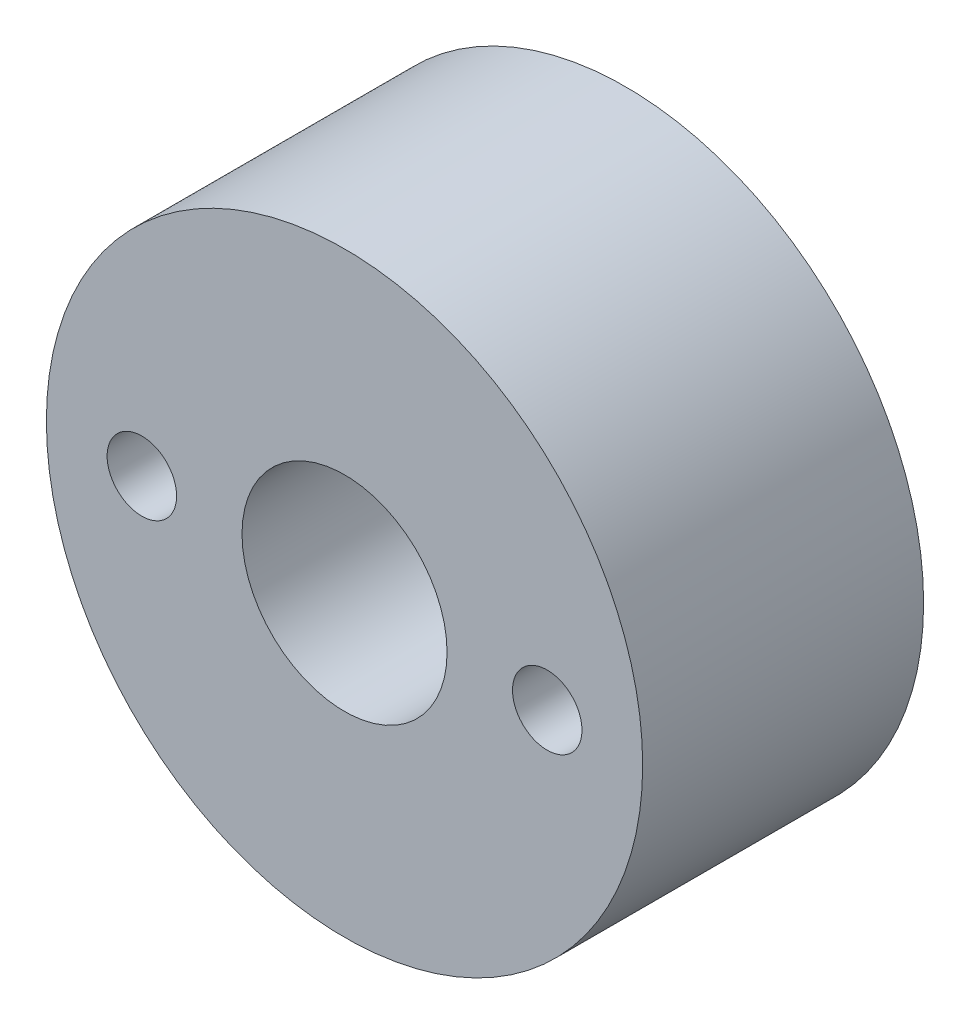
ISO-10303-21;
HEADER;
FILE_DESCRIPTION(('STEP AP214'),'2;1');
FILE_NAME('part.step','',(''),(''),'','','');
FILE_SCHEMA(('AUTOMOTIVE_DESIGN { 1 0 10303 214 1 1 1 1 }'));
ENDSEC;
DATA;
#1=APPLICATION_CONTEXT('core data for automotive mechanical design processes');
#2=APPLICATION_PROTOCOL_DEFINITION('international standard','automotive_design',2000,#1);
#3=PRODUCT_CONTEXT('',#1,'mechanical');
#4=PRODUCT('Part','Part','',(#3));
#5=PRODUCT_RELATED_PRODUCT_CATEGORY('part','',(#4));
#6=PRODUCT_DEFINITION_FORMATION('','',#4);
#7=PRODUCT_DEFINITION_CONTEXT('part definition',#1,'design');
#8=PRODUCT_DEFINITION('design','',#6,#7);
#9=PRODUCT_DEFINITION_SHAPE('','',#8);
#10=(LENGTH_UNIT() NAMED_UNIT(*) SI_UNIT(.MILLI.,.METRE.));
#11=(NAMED_UNIT(*) PLANE_ANGLE_UNIT() SI_UNIT($,.RADIAN.));
#12=(NAMED_UNIT(*) SI_UNIT($,.STERADIAN.) SOLID_ANGLE_UNIT());
#13=UNCERTAINTY_MEASURE_WITH_UNIT(LENGTH_MEASURE(1.E-05),#10,'distance_accuracy_value','');
#14=(GEOMETRIC_REPRESENTATION_CONTEXT(3) GLOBAL_UNCERTAINTY_ASSIGNED_CONTEXT((#13)) GLOBAL_UNIT_ASSIGNED_CONTEXT((#10,
#11,#12)) REPRESENTATION_CONTEXT('',''));
#15=CARTESIAN_POINT('',(0.,0.,0.));
#16=DIRECTION('',(0.,0.,1.));
#17=DIRECTION('',(1.,0.,0.));
#18=AXIS2_PLACEMENT_3D('',#15,#16,#17);
#19=CARTESIAN_POINT('',(18.9434723123043,23.6735889318227,0.));
#20=DIRECTION('',(0.,0.,-1.));
#21=DIRECTION('',(-1.,0.,0.));
#22=AXIS2_PLACEMENT_3D('',#19,#20,#21);
#23=PLANE('',#22);
#24=CARTESIAN_POINT('',(0.,0.,0.));
#25=DIRECTION('',(0.,0.,-1.));
#26=DIRECTION('',(-1.,0.,0.));
#27=AXIS2_PLACEMENT_3D('',#24,#25,#26);
#28=CIRCLE('',#27,14.5880115884789);
#29=CARTESIAN_POINT('',(-14.5880115884789,0.,0.));
#30=VERTEX_POINT('',#29);
#31=EDGE_CURVE('E40',#30,#30,#28,.T.);
#32=ORIENTED_EDGE('',*,*,#31,.F.);
#33=EDGE_LOOP('',(#32));
#34=FACE_BOUND('',#33,.T.);
#35=CARTESIAN_POINT('',(9.91665428511723,0.,0.));
#36=DIRECTION('',(0.,0.,-1.));
#37=DIRECTION('',(-1.,0.,0.));
#38=AXIS2_PLACEMENT_3D('',#35,#36,#37);
#39=CIRCLE('',#38,1.7);
#40=CARTESIAN_POINT('',(11.6166542851172,0.,0.));
#41=VERTEX_POINT('',#40);
#42=EDGE_CURVE('E55',#41,#41,#39,.T.);
#43=ORIENTED_EDGE('',*,*,#42,.T.);
#44=EDGE_LOOP('',(#43));
#45=FACE_BOUND('',#44,.T.);
#46=CARTESIAN_POINT('',(-9.91665428511723,0.,0.));
#47=DIRECTION('',(0.,0.,-1.));
#48=DIRECTION('',(-1.,0.,0.));
#49=AXIS2_PLACEMENT_3D('',#46,#47,#48);
#50=CIRCLE('',#49,1.7);
#51=CARTESIAN_POINT('',(-8.21665428511723,0.,0.));
#52=VERTEX_POINT('',#51);
#53=EDGE_CURVE('E58',#52,#52,#50,.T.);
#54=ORIENTED_EDGE('',*,*,#53,.T.);
#55=EDGE_LOOP('',(#54));
#56=FACE_BOUND('',#55,.T.);
#57=CARTESIAN_POINT('',(0.,0.,0.));
#58=DIRECTION('',(0.,0.,-1.));
#59=DIRECTION('',(-1.,0.,0.));
#60=AXIS2_PLACEMENT_3D('',#57,#58,#59);
#61=CIRCLE('',#60,5.0165);
#62=CARTESIAN_POINT('',(-5.0165,0.,0.));
#63=VERTEX_POINT('',#62);
#64=EDGE_CURVE('E60',#63,#63,#61,.F.);
#65=ORIENTED_EDGE('',*,*,#64,.F.);
#66=EDGE_LOOP('',(#65));
#67=FACE_BOUND('',#66,.T.);
#68=ADVANCED_FACE('F36',(#34,#45,#56,#67),#23,.F.);
#69=CARTESIAN_POINT('',(-8.32907412950175,5.3820587469665,-11.745));
#70=DIRECTION('',(0.,0.,1.));
#71=DIRECTION('',(1.,0.,0.));
#72=AXIS2_PLACEMENT_3D('',#69,#70,#71);
#73=PLANE('',#72);
#74=CARTESIAN_POINT('',(-8.32907412950175,5.3820587469665,-11.745));
#75=DIRECTION('',(0.,0.,-1.));
#76=DIRECTION('',(1.,0.,0.));
#77=AXIS2_PLACEMENT_3D('',#74,#75,#76);
#78=CIRCLE('',#77,1.2);
#79=CARTESIAN_POINT('',(-7.12907412950175,5.3820587469665,-11.745));
#80=VERTEX_POINT('',#79);
#81=EDGE_CURVE('E90',#80,#80,#78,.T.);
#82=ORIENTED_EDGE('',*,*,#81,.T.);
#83=EDGE_LOOP('',(#82));
#84=FACE_BOUND('',#83,.T.);
#85=ADVANCED_FACE('F100',(#84),#73,.F.);
#86=CARTESIAN_POINT('',(-8.32907412950175,-5.3820587469665,-11.745));
#87=DIRECTION('',(0.,0.,-1.));
#88=DIRECTION('',(-1.,0.,0.));
#89=AXIS2_PLACEMENT_3D('',#86,#87,#88);
#90=PLANE('',#89);
#91=CARTESIAN_POINT('',(-8.32907412950175,-5.3820587469665,-11.745));
#92=DIRECTION('',(0.,0.,-1.));
#93=DIRECTION('',(-1.,0.,0.));
#94=AXIS2_PLACEMENT_3D('',#91,#92,#93);
#95=CIRCLE('',#94,1.2);
#96=CARTESIAN_POINT('',(-9.52907412950175,-5.3820587469665,-11.745));
#97=VERTEX_POINT('',#96);
#98=EDGE_CURVE('E85',#97,#97,#95,.T.);
#99=ORIENTED_EDGE('',*,*,#98,.T.);
#100=EDGE_LOOP('',(#99));
#101=FACE_BOUND('',#100,.T.);
#102=ADVANCED_FACE('F133',(#101),#90,.T.);
#103=CARTESIAN_POINT('',(-9.91665428511723,0.,-16.745));
#104=DIRECTION('',(0.,0.,1.));
#105=DIRECTION('',(1.,0.,0.));
#106=AXIS2_PLACEMENT_3D('',#103,#104,#105);
#107=CYLINDRICAL_SURFACE('',#106,2.8);
#108=CARTESIAN_POINT('',(-9.91665428511723,0.,-16.745));
#109=DIRECTION('',(0.,0.,-1.));
#110=DIRECTION('',(-1.,0.,0.));
#111=AXIS2_PLACEMENT_3D('',#108,#109,#110);
#112=CIRCLE('',#111,2.8);
#113=CARTESIAN_POINT('',(-12.7166542851172,0.,-16.745));
#114=VERTEX_POINT('',#113);
#115=EDGE_CURVE('E45',#114,#114,#112,.T.);
#116=ORIENTED_EDGE('',*,*,#115,.F.);
#117=EDGE_LOOP('',(#116));
#118=FACE_BOUND('',#117,.T.);
#119=CARTESIAN_POINT('',(-9.91665428511723,0.,-13.745));
#120=DIRECTION('',(0.,0.,1.));
#121=DIRECTION('',(1.,0.,0.));
#122=AXIS2_PLACEMENT_3D('',#119,#120,#121);
#123=CIRCLE('',#122,2.8);
#124=CARTESIAN_POINT('',(-7.11665428511723,0.,-13.745));
#125=VERTEX_POINT('',#124);
#126=EDGE_CURVE('E62',#125,#125,#123,.F.);
#127=ORIENTED_EDGE('',*,*,#126,.T.);
#128=EDGE_LOOP('',(#127));
#129=FACE_BOUND('',#128,.T.);
#130=ADVANCED_FACE('F141',(#118,#129),#107,.T.);
#131=CARTESIAN_POINT('',(-9.91665428511723,0.,-16.745));
#132=DIRECTION('',(0.,0.,-1.));
#133=DIRECTION('',(-1.,0.,0.));
#134=AXIS2_PLACEMENT_3D('',#131,#132,#133);
#135=PLANE('',#134);
#136=ORIENTED_EDGE('',*,*,#115,.T.);
#137=EDGE_LOOP('',(#136));
#138=FACE_BOUND('',#137,.T.);
#139=CARTESIAN_POINT('',(-9.91665428511723,0.,-16.745));
#140=DIRECTION('',(0.,0.,-1.));
#141=DIRECTION('',(-1.,0.,0.));
#142=AXIS2_PLACEMENT_3D('',#139,#140,#141);
#143=CIRCLE('',#142,1.7);
#144=CARTESIAN_POINT('',(-8.21665428511723,0.,-16.745));
#145=VERTEX_POINT('',#144);
#146=EDGE_CURVE('E10',#145,#145,#143,.T.);
#147=ORIENTED_EDGE('',*,*,#146,.F.);
#148=EDGE_LOOP('',(#147));
#149=FACE_BOUND('',#148,.T.);
#150=ADVANCED_FACE('F138',(#138,#149),#135,.T.);
#151=CARTESIAN_POINT('',(-9.91665428511723,0.,-21.2539484015982));
#152=DIRECTION('',(0.,0.,1.));
#153=DIRECTION('',(1.,0.,0.));
#154=AXIS2_PLACEMENT_3D('',#151,#152,#153);
#155=CYLINDRICAL_SURFACE('',#154,1.7);
#156=CARTESIAN_POINT('',(-8.21665428511723,0.,0.));
#157=CARTESIAN_POINT('',(-8.21665428511723,0.,-0.17442708333333));
#158=CARTESIAN_POINT('',(-8.21665428511723,0.,-0.348854166666663));
#159=CARTESIAN_POINT('',(-8.21665428511723,0.,-0.69770833333333));
#160=CARTESIAN_POINT('',(-8.21665428511723,0.,-0.872135416666664));
#161=CARTESIAN_POINT('',(-8.21665428511723,0.,-1.22098958333333));
#162=CARTESIAN_POINT('',(-8.21665428511723,0.,-1.39541666666666));
#163=CARTESIAN_POINT('',(-8.21665428511723,0.,-1.74427083333333));
#164=CARTESIAN_POINT('',(-8.21665428511723,0.,-1.91869791666666));
#165=CARTESIAN_POINT('',(-8.21665428511723,0.,-2.26755208333333));
#166=CARTESIAN_POINT('',(-8.21665428511723,0.,-2.44197916666666));
#167=CARTESIAN_POINT('',(-8.21665428511723,0.,-2.79083333333333));
#168=CARTESIAN_POINT('',(-8.21665428511723,0.,-2.96526041666666));
#169=CARTESIAN_POINT('',(-8.21665428511723,0.,-3.31411458333333));
#170=CARTESIAN_POINT('',(-8.21665428511723,0.,-3.48854166666667));
#171=CARTESIAN_POINT('',(-8.21665428511723,0.,-3.83739583333333));
#172=CARTESIAN_POINT('',(-8.21665428511723,0.,-4.01182291666667));
#173=CARTESIAN_POINT('',(-8.21665428511723,0.,-4.36067708333333));
#174=CARTESIAN_POINT('',(-8.21665428511723,0.,-4.53510416666667));
#175=CARTESIAN_POINT('',(-8.21665428511723,0.,-4.88395833333333));
#176=CARTESIAN_POINT('',(-8.21665428511723,0.,-5.05838541666667));
#177=CARTESIAN_POINT('',(-8.21665428511723,0.,-5.40723958333333));
#178=CARTESIAN_POINT('',(-8.21665428511723,0.,-5.58166666666667));
#179=CARTESIAN_POINT('',(-8.21665428511723,0.,-5.93052083333333));
#180=CARTESIAN_POINT('',(-8.21665428511723,0.,-6.10494791666666));
#181=CARTESIAN_POINT('',(-8.21665428511723,0.,-6.45380208333333));
#182=CARTESIAN_POINT('',(-8.21665428511723,0.,-6.62822916666666));
#183=CARTESIAN_POINT('',(-8.21665428511723,0.,-6.97708333333333));
#184=CARTESIAN_POINT('',(-8.21665428511723,0.,-7.15151041666666));
#185=CARTESIAN_POINT('',(-8.21665428511723,0.,-7.50036458333333));
#186=CARTESIAN_POINT('',(-8.21665428511723,0.,-7.67479166666666));
#187=CARTESIAN_POINT('',(-8.21665428511723,0.,-8.02364583333333));
#188=CARTESIAN_POINT('',(-8.21665428511723,0.,-8.19807291666667));
#189=CARTESIAN_POINT('',(-8.21665428511723,0.,-8.54692708333333));
#190=CARTESIAN_POINT('',(-8.21665428511723,0.,-8.72135416666667));
#191=CARTESIAN_POINT('',(-8.21665428511723,0.,-9.07020833333333));
#192=CARTESIAN_POINT('',(-8.21665428511723,0.,-9.24463541666667));
#193=CARTESIAN_POINT('',(-8.21665428511723,0.,-9.59348958333333));
#194=CARTESIAN_POINT('',(-8.21665428511723,0.,-9.76791666666667));
#195=CARTESIAN_POINT('',(-8.21665428511723,0.,-10.1167708333333));
#196=CARTESIAN_POINT('',(-8.21665428511723,0.,-10.2911979166667));
#197=CARTESIAN_POINT('',(-8.21665428511723,0.,-10.6400520833333));
#198=CARTESIAN_POINT('',(-8.21665428511723,0.,-10.8144791666667));
#199=CARTESIAN_POINT('',(-8.21665428511723,0.,-11.1633333333333));
#200=CARTESIAN_POINT('',(-8.21665428511723,0.,-11.3377604166667));
#201=CARTESIAN_POINT('',(-8.21665428511723,0.,-11.6866145833333));
#202=CARTESIAN_POINT('',(-8.21665428511723,0.,-11.8610416666667));
#203=CARTESIAN_POINT('',(-8.21665428511723,0.,-12.2098958333333));
#204=CARTESIAN_POINT('',(-8.21665428511723,0.,-12.3843229166667));
#205=CARTESIAN_POINT('',(-8.21665428511723,0.,-12.7331770833333));
#206=CARTESIAN_POINT('',(-8.21665428511723,0.,-12.9076041666667));
#207=CARTESIAN_POINT('',(-8.21665428511723,0.,-13.2564583333333));
#208=CARTESIAN_POINT('',(-8.21665428511723,0.,-13.4308854166667));
#209=CARTESIAN_POINT('',(-8.21665428511723,0.,-13.7797395833333));
#210=CARTESIAN_POINT('',(-8.21665428511723,0.,-13.9541666666667));
#211=CARTESIAN_POINT('',(-8.21665428511723,0.,-14.3030208333333));
#212=CARTESIAN_POINT('',(-8.21665428511723,0.,-14.4774479166667));
#213=CARTESIAN_POINT('',(-8.21665428511723,0.,-14.8263020833333));
#214=CARTESIAN_POINT('',(-8.21665428511723,0.,-15.0007291666667));
#215=CARTESIAN_POINT('',(-8.21665428511723,0.,-15.3495833333333));
#216=CARTESIAN_POINT('',(-8.21665428511723,0.,-15.5240104166667));
#217=CARTESIAN_POINT('',(-8.21665428511723,0.,-15.8728645833333));
#218=CARTESIAN_POINT('',(-8.21665428511723,0.,-16.0472916666667));
#219=CARTESIAN_POINT('',(-8.21665428511723,0.,-16.3961458333333));
#220=CARTESIAN_POINT('',(-8.21665428511723,0.,-16.5705729166667));
#221=CARTESIAN_POINT('',(-8.21665428511723,0.,-16.745));
#222=B_SPLINE_CURVE_WITH_KNOTS('',3,(#156,#157,#158,#159,#160,#161,#162,#163,#164,#165,#166,
#167,#168,#169,#170,#171,#172,#173,#174,#175,#176,#177,#178,#179,#180,#181,#182,#183,#184,#185,
#186,#187,#188,#189,#190,#191,#192,#193,#194,#195,#196,#197,#198,#199,#200,#201,#202,#203,#204,
#205,#206,#207,#208,#209,#210,#211,#212,#213,#214,#215,#216,#217,#218,#219,#220,#221),
.UNSPECIFIED.,.F.,.F.,(4,2,2,2,2,2,2,2,2,2,2,2,2,2,2,2,2,2,2,2,2,2,2,2,2,2,2,2,2,2,2,2,4),(0.,
0.52328125,1.0465625,1.56984375,2.093125,2.61640625,3.1396875,3.66296875,4.18625,4.70953125,
5.2328125,5.75609375,6.279375,6.80265625,7.3259375,7.84921875,8.3725,8.89578125,9.4190625,
9.94234375,10.465625,10.98890625,11.5121875,12.03546875,12.55875,13.08203125,13.6053125,
14.12859375,14.651875,15.17515625,15.6984375,16.22171875,16.745),.UNSPECIFIED.);
#223=EDGE_CURVE('BSEAM106',#52,#145,#222,.T.);
#224=ORIENTED_EDGE('',*,*,#53,.F.);
#225=ORIENTED_EDGE('',*,*,#146,.T.);
#226=ORIENTED_EDGE('',*,*,#223,.T.);
#227=ORIENTED_EDGE('',*,*,#223,.F.);
#228=EDGE_LOOP('',(#224,#226,#225,#227));
#229=FACE_BOUND('',#228,.T.);
#230=ADVANCED_FACE('F106',(#229),#155,.F.);
#231=CARTESIAN_POINT('',(-8.32907412950175,5.3820587469665,-11.745));
#232=DIRECTION('',(0.,0.,-1.));
#233=DIRECTION('',(-1.,0.,0.));
#234=AXIS2_PLACEMENT_3D('',#231,#232,#233);
#235=CYLINDRICAL_SURFACE('',#234,1.2);
#236=ORIENTED_EDGE('',*,*,#81,.F.);
#237=EDGE_LOOP('',(#236));
#238=FACE_BOUND('',#237,.T.);
#239=CARTESIAN_POINT('',(-8.32907412950175,5.3820587469665,-13.745));
#240=DIRECTION('',(0.,0.,-1.));
#241=DIRECTION('',(1.,0.,0.));
#242=AXIS2_PLACEMENT_3D('',#239,#240,#241);
#243=CIRCLE('',#242,1.2);
#244=CARTESIAN_POINT('',(-7.12907412950175,5.3820587469665,-13.745));
#245=VERTEX_POINT('',#244);
#246=EDGE_CURVE('E51',#245,#245,#243,.T.);
#247=ORIENTED_EDGE('',*,*,#246,.T.);
#248=EDGE_LOOP('',(#247));
#249=FACE_BOUND('',#248,.T.);
#250=ADVANCED_FACE('F102',(#238,#249),#235,.F.);
#251=CARTESIAN_POINT('',(-8.32907412950175,-5.3820587469665,-11.745));
#252=DIRECTION('',(0.,0.,-1.));
#253=DIRECTION('',(-1.,0.,0.));
#254=AXIS2_PLACEMENT_3D('',#251,#252,#253);
#255=CYLINDRICAL_SURFACE('',#254,1.2);
#256=ORIENTED_EDGE('',*,*,#98,.F.);
#257=EDGE_LOOP('',(#256));
#258=FACE_BOUND('',#257,.T.);
#259=CARTESIAN_POINT('',(-8.32907412950175,-5.3820587469665,-13.745));
#260=DIRECTION('',(0.,0.,-1.));
#261=DIRECTION('',(-1.,0.,0.));
#262=AXIS2_PLACEMENT_3D('',#259,#260,#261);
#263=CIRCLE('',#262,1.2);
#264=CARTESIAN_POINT('',(-9.52907412950175,-5.3820587469665,-13.745));
#265=VERTEX_POINT('',#264);
#266=EDGE_CURVE('E86',#265,#265,#263,.T.);
#267=ORIENTED_EDGE('',*,*,#266,.T.);
#268=EDGE_LOOP('',(#267));
#269=FACE_BOUND('',#268,.T.);
#270=ADVANCED_FACE('F105',(#258,#269),#255,.F.);
#271=CARTESIAN_POINT('',(0.,0.,-13.745));
#272=DIRECTION('',(0.,0.,1.));
#273=DIRECTION('',(1.,0.,0.));
#274=AXIS2_PLACEMENT_3D('',#271,#272,#273);
#275=PLANE('',#274);
#276=CARTESIAN_POINT('',(9.91665428511723,0.,-13.745));
#277=DIRECTION('',(0.,0.,1.));
#278=DIRECTION('',(1.,0.,0.));
#279=AXIS2_PLACEMENT_3D('',#276,#277,#278);
#280=CIRCLE('',#279,1.7);
#281=CARTESIAN_POINT('',(11.6166542851172,0.,-13.745));
#282=VERTEX_POINT('',#281);
#283=EDGE_CURVE('E78',#282,#282,#280,.T.);
#284=ORIENTED_EDGE('',*,*,#283,.T.);
#285=EDGE_LOOP('',(#284));
#286=FACE_BOUND('',#285,.T.);
#287=CARTESIAN_POINT('',(0.,0.,-13.745));
#288=DIRECTION('',(0.,0.,-1.));
#289=DIRECTION('',(-1.,0.,0.));
#290=AXIS2_PLACEMENT_3D('',#287,#288,#289);
#291=CIRCLE('',#290,14.5880115884789);
#292=CARTESIAN_POINT('',(-14.5880115884789,0.,-13.745));
#293=VERTEX_POINT('',#292);
#294=EDGE_CURVE('E72',#293,#293,#291,.F.);
#295=ORIENTED_EDGE('',*,*,#294,.F.);
#296=EDGE_LOOP('',(#295));
#297=FACE_BOUND('',#296,.T.);
#298=CARTESIAN_POINT('',(0.,0.,-13.745));
#299=DIRECTION('',(0.,0.,1.));
#300=DIRECTION('',(1.,0.,0.));
#301=AXIS2_PLACEMENT_3D('',#298,#299,#300);
#302=CIRCLE('',#301,5.0165);
#303=CARTESIAN_POINT('',(5.0165,0.,-13.745));
#304=VERTEX_POINT('',#303);
#305=EDGE_CURVE('E74',#304,#304,#302,.F.);
#306=ORIENTED_EDGE('',*,*,#305,.F.);
#307=EDGE_LOOP('',(#306));
#308=FACE_BOUND('',#307,.T.);
#309=ORIENTED_EDGE('',*,*,#266,.F.);
#310=EDGE_LOOP('',(#309));
#311=FACE_BOUND('',#310,.T.);
#312=ORIENTED_EDGE('',*,*,#246,.F.);
#313=EDGE_LOOP('',(#312));
#314=FACE_BOUND('',#313,.T.);
#315=ORIENTED_EDGE('',*,*,#126,.F.);
#316=EDGE_LOOP('',(#315));
#317=FACE_BOUND('',#316,.T.);
#318=ADVANCED_FACE('F110',(#286,#297,#308,#311,#314,#317),#275,.F.);
#319=CARTESIAN_POINT('',(9.91665428511723,0.,-22.6258017650538));
#320=DIRECTION('',(0.,0.,1.));
#321=DIRECTION('',(1.,0.,0.));
#322=AXIS2_PLACEMENT_3D('',#319,#320,#321);
#323=CYLINDRICAL_SURFACE('',#322,1.7);
#324=CARTESIAN_POINT('',(11.6166542851172,0.,-13.745));
#325=CARTESIAN_POINT('',(11.6166542851172,0.,-13.6018229166667));
#326=CARTESIAN_POINT('',(11.6166542851172,0.,-13.4586458333333));
#327=CARTESIAN_POINT('',(11.6166542851172,0.,-13.1722916666667));
#328=CARTESIAN_POINT('',(11.6166542851172,0.,-13.0291145833333));
#329=CARTESIAN_POINT('',(11.6166542851172,0.,-12.7427604166667));
#330=CARTESIAN_POINT('',(11.6166542851172,0.,-12.5995833333333));
#331=CARTESIAN_POINT('',(11.6166542851172,0.,-12.3132291666667));
#332=CARTESIAN_POINT('',(11.6166542851172,0.,-12.1700520833333));
#333=CARTESIAN_POINT('',(11.6166542851172,0.,-11.8836979166667));
#334=CARTESIAN_POINT('',(11.6166542851172,0.,-11.7405208333333));
#335=CARTESIAN_POINT('',(11.6166542851172,0.,-11.4541666666667));
#336=CARTESIAN_POINT('',(11.6166542851172,0.,-11.3109895833333));
#337=CARTESIAN_POINT('',(11.6166542851172,0.,-11.0246354166667));
#338=CARTESIAN_POINT('',(11.6166542851172,0.,-10.8814583333333));
#339=CARTESIAN_POINT('',(11.6166542851172,0.,-10.5951041666667));
#340=CARTESIAN_POINT('',(11.6166542851172,0.,-10.4519270833333));
#341=CARTESIAN_POINT('',(11.6166542851172,0.,-10.1655729166667));
#342=CARTESIAN_POINT('',(11.6166542851172,0.,-10.0223958333333));
#343=CARTESIAN_POINT('',(11.6166542851172,0.,-9.73604166666667));
#344=CARTESIAN_POINT('',(11.6166542851172,0.,-9.59286458333333));
#345=CARTESIAN_POINT('',(11.6166542851172,0.,-9.30651041666667));
#346=CARTESIAN_POINT('',(11.6166542851172,0.,-9.16333333333333));
#347=CARTESIAN_POINT('',(11.6166542851172,0.,-8.87697916666667));
#348=CARTESIAN_POINT('',(11.6166542851172,0.,-8.73380208333333));
#349=CARTESIAN_POINT('',(11.6166542851172,0.,-8.44744791666667));
#350=CARTESIAN_POINT('',(11.6166542851172,0.,-8.30427083333333));
#351=CARTESIAN_POINT('',(11.6166542851172,0.,-8.01791666666667));
#352=CARTESIAN_POINT('',(11.6166542851172,0.,-7.87473958333333));
#353=CARTESIAN_POINT('',(11.6166542851172,0.,-7.58838541666667));
#354=CARTESIAN_POINT('',(11.6166542851172,0.,-7.44520833333333));
#355=CARTESIAN_POINT('',(11.6166542851172,0.,-7.15885416666667));
#356=CARTESIAN_POINT('',(11.6166542851172,0.,-7.01567708333333));
#357=CARTESIAN_POINT('',(11.6166542851172,0.,-6.72932291666667));
#358=CARTESIAN_POINT('',(11.6166542851172,0.,-6.58614583333333));
#359=CARTESIAN_POINT('',(11.6166542851172,0.,-6.29979166666667));
#360=CARTESIAN_POINT('',(11.6166542851172,0.,-6.15661458333333));
#361=CARTESIAN_POINT('',(11.6166542851172,0.,-5.87026041666667));
#362=CARTESIAN_POINT('',(11.6166542851172,0.,-5.72708333333333));
#363=CARTESIAN_POINT('',(11.6166542851172,0.,-5.44072916666667));
#364=CARTESIAN_POINT('',(11.6166542851172,0.,-5.29755208333333));
#365=CARTESIAN_POINT('',(11.6166542851172,0.,-5.01119791666667));
#366=CARTESIAN_POINT('',(11.6166542851172,0.,-4.86802083333333));
#367=CARTESIAN_POINT('',(11.6166542851172,0.,-4.58166666666667));
#368=CARTESIAN_POINT('',(11.6166542851172,0.,-4.43848958333333));
#369=CARTESIAN_POINT('',(11.6166542851172,0.,-4.15213541666667));
#370=CARTESIAN_POINT('',(11.6166542851172,0.,-4.00895833333333));
#371=CARTESIAN_POINT('',(11.6166542851172,0.,-3.72260416666667));
#372=CARTESIAN_POINT('',(11.6166542851172,0.,-3.57942708333333));
#373=CARTESIAN_POINT('',(11.6166542851172,0.,-3.29307291666667));
#374=CARTESIAN_POINT('',(11.6166542851172,0.,-3.14989583333333));
#375=CARTESIAN_POINT('',(11.6166542851172,0.,-2.86354166666666));
#376=CARTESIAN_POINT('',(11.6166542851172,0.,-2.72036458333333));
#377=CARTESIAN_POINT('',(11.6166542851172,0.,-2.43401041666666));
#378=CARTESIAN_POINT('',(11.6166542851172,0.,-2.29083333333333));
#379=CARTESIAN_POINT('',(11.6166542851172,0.,-2.00447916666666));
#380=CARTESIAN_POINT('',(11.6166542851172,0.,-1.86130208333333));
#381=CARTESIAN_POINT('',(11.6166542851172,0.,-1.57494791666666));
#382=CARTESIAN_POINT('',(11.6166542851172,0.,-1.43177083333333));
#383=CARTESIAN_POINT('',(11.6166542851172,0.,-1.14541666666666));
#384=CARTESIAN_POINT('',(11.6166542851172,0.,-1.00223958333333));
#385=CARTESIAN_POINT('',(11.6166542851172,0.,-0.715885416666664));
#386=CARTESIAN_POINT('',(11.6166542851172,0.,-0.57270833333333));
#387=CARTESIAN_POINT('',(11.6166542851172,0.,-0.286354166666663));
#388=CARTESIAN_POINT('',(11.6166542851172,0.,-0.14317708333333));
#389=CARTESIAN_POINT('',(11.6166542851172,0.,0.));
#390=B_SPLINE_CURVE_WITH_KNOTS('',3,(#324,#325,#326,#327,#328,#329,#330,#331,#332,#333,#334,
#335,#336,#337,#338,#339,#340,#341,#342,#343,#344,#345,#346,#347,#348,#349,#350,#351,#352,#353,
#354,#355,#356,#357,#358,#359,#360,#361,#362,#363,#364,#365,#366,#367,#368,#369,#370,#371,#372,
#373,#374,#375,#376,#377,#378,#379,#380,#381,#382,#383,#384,#385,#386,#387,#388,#389),
.UNSPECIFIED.,.F.,.F.,(4,2,2,2,2,2,2,2,2,2,2,2,2,2,2,2,2,2,2,2,2,2,2,2,2,2,2,2,2,2,2,2,4),(0.,
0.42953125,0.859062500000001,1.28859375,1.718125,2.14765625,2.5771875,3.00671875,3.43625,
3.86578125,4.2953125,4.72484375,5.154375,5.58390625,6.0134375,6.44296875,6.8725,7.30203125,
7.7315625,8.16109375,8.590625,9.02015625,9.4496875,9.87921875,10.30875,10.73828125,11.1678125,
11.59734375,12.026875,12.45640625,12.8859375,13.31546875,13.745),.UNSPECIFIED.);
#391=EDGE_CURVE('BSEAM113',#282,#41,#390,.T.);
#392=ORIENTED_EDGE('',*,*,#283,.F.);
#393=ORIENTED_EDGE('',*,*,#42,.F.);
#394=ORIENTED_EDGE('',*,*,#391,.T.);
#395=ORIENTED_EDGE('',*,*,#391,.F.);
#396=EDGE_LOOP('',(#392,#394,#393,#395));
#397=FACE_BOUND('',#396,.T.);
#398=ADVANCED_FACE('F113',(#397),#323,.F.);
#399=CARTESIAN_POINT('',(0.,0.,0.999999999999997));
#400=DIRECTION('',(0.,0.,-1.));
#401=DIRECTION('',(-1.,0.,0.));
#402=AXIS2_PLACEMENT_3D('',#399,#400,#401);
#403=CYLINDRICAL_SURFACE('',#402,14.5880115884789);
#404=ORIENTED_EDGE('',*,*,#294,.T.);
#405=EDGE_LOOP('',(#404));
#406=FACE_BOUND('',#405,.T.);
#407=ORIENTED_EDGE('',*,*,#31,.T.);
#408=EDGE_LOOP('',(#407));
#409=FACE_BOUND('',#408,.T.);
#410=ADVANCED_FACE('F120',(#406,#409),#403,.T.);
#411=CARTESIAN_POINT('',(0.,0.,0.));
#412=DIRECTION('',(0.,0.,1.));
#413=DIRECTION('',(1.,0.,0.));
#414=AXIS2_PLACEMENT_3D('',#411,#412,#413);
#415=CYLINDRICAL_SURFACE('',#414,5.0165);
#416=ORIENTED_EDGE('',*,*,#64,.T.);
#417=EDGE_LOOP('',(#416));
#418=FACE_BOUND('',#417,.T.);
#419=ORIENTED_EDGE('',*,*,#305,.T.);
#420=EDGE_LOOP('',(#419));
#421=FACE_BOUND('',#420,.T.);
#422=ADVANCED_FACE('F38',(#418,#421),#415,.F.);
#423=CLOSED_SHELL('',(#68,#85,#102,#130,#150,#230,#250,#270,#318,#398,#410,#422));
#424=MANIFOLD_SOLID_BREP('B2',#423);
#425=ADVANCED_BREP_SHAPE_REPRESENTATION('',(#18,#424),#14);
#426=SHAPE_DEFINITION_REPRESENTATION(#9,#425);
ENDSEC;
END-ISO-10303-21;
